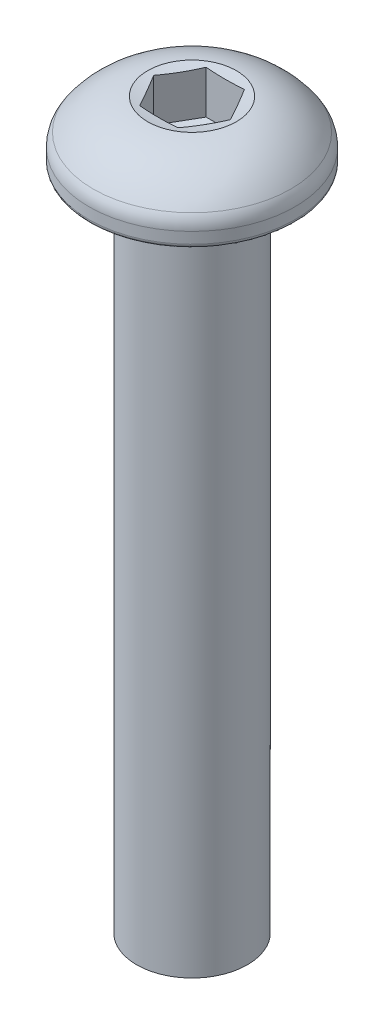
ISO-10303-21;
HEADER;
FILE_DESCRIPTION(('STEP AP214'),'2;1');
FILE_NAME('part.step','',(''),(''),'','','');
FILE_SCHEMA(('AUTOMOTIVE_DESIGN { 1 0 10303 214 1 1 1 1 }'));
ENDSEC;
DATA;
#1=APPLICATION_CONTEXT('core data for automotive mechanical design processes');
#2=APPLICATION_PROTOCOL_DEFINITION('international standard','automotive_design',2000,#1);
#3=PRODUCT_CONTEXT('',#1,'mechanical');
#4=PRODUCT('Part','Part','',(#3));
#5=PRODUCT_RELATED_PRODUCT_CATEGORY('part','',(#4));
#6=PRODUCT_DEFINITION_FORMATION('','',#4);
#7=PRODUCT_DEFINITION_CONTEXT('part definition',#1,'design');
#8=PRODUCT_DEFINITION('design','',#6,#7);
#9=PRODUCT_DEFINITION_SHAPE('','',#8);
#10=(LENGTH_UNIT() NAMED_UNIT(*) SI_UNIT(.MILLI.,.METRE.));
#11=(NAMED_UNIT(*) PLANE_ANGLE_UNIT() SI_UNIT($,.RADIAN.));
#12=(NAMED_UNIT(*) SI_UNIT($,.STERADIAN.) SOLID_ANGLE_UNIT());
#13=UNCERTAINTY_MEASURE_WITH_UNIT(LENGTH_MEASURE(1.E-05),#10,'distance_accuracy_value','');
#14=(GEOMETRIC_REPRESENTATION_CONTEXT(3) GLOBAL_UNCERTAINTY_ASSIGNED_CONTEXT((#13)) GLOBAL_UNIT_ASSIGNED_CONTEXT((#10,
#11,#12)) REPRESENTATION_CONTEXT('',''));
#15=CARTESIAN_POINT('',(0.,0.,0.));
#16=DIRECTION('',(0.,0.,1.));
#17=DIRECTION('',(1.,0.,0.));
#18=AXIS2_PLACEMENT_3D('',#15,#16,#17);
#19=CARTESIAN_POINT('',(0.,-0.781135566534529,0.));
#20=DIRECTION('',(0.,1.,0.));
#21=DIRECTION('',(0.,0.,1.));
#22=AXIS2_PLACEMENT_3D('',#19,#20,#21);
#23=DEGENERATE_TOROIDAL_SURFACE('',#22,1.63710171203445,3.5,.T.);
#24=CARTESIAN_POINT('',(0.,1.29456945714261,0.));
#25=DIRECTION('',(0.,-1.,0.));
#26=DIRECTION('',(0.,0.,-1.));
#27=AXIS2_PLACEMENT_3D('',#24,#25,#26);
#28=CIRCLE('',#27,4.45515931518622);
#29=CARTESIAN_POINT('',(0.,1.29456945714261,-4.45515931518622));
#30=VERTEX_POINT('',#29);
#31=EDGE_CURVE('E135',#30,#30,#28,.F.);
#32=ORIENTED_EDGE('',*,*,#31,.T.);
#33=EDGE_LOOP('',(#32));
#34=FACE_BOUND('',#33,.T.);
#35=CARTESIAN_POINT('',(0.,2.7,0.));
#36=DIRECTION('',(0.,1.,0.));
#37=DIRECTION('',(0.,0.,1.));
#38=AXIS2_PLACEMENT_3D('',#35,#36,#37);
#39=CIRCLE('',#38,2.);
#40=CARTESIAN_POINT('',(0.,2.7,2.));
#41=VERTEX_POINT('',#40);
#42=EDGE_CURVE('E209',#41,#41,#39,.T.);
#43=ORIENTED_EDGE('',*,*,#42,.F.);
#44=EDGE_LOOP('',(#43));
#45=FACE_BOUND('',#44,.T.);
#46=ADVANCED_FACE('F41',(#34,#45),#23,.T.);
#47=CARTESIAN_POINT('',(0.,55.,0.));
#48=DIRECTION('',(0.,1.,0.));
#49=DIRECTION('',(0.,0.,1.));
#50=AXIS2_PLACEMENT_3D('',#47,#48,#49);
#51=CYLINDRICAL_SURFACE('',#50,4.65);
#52=CARTESIAN_POINT('',(0.,0.701510878949145,0.));
#53=DIRECTION('',(0.,-1.,0.));
#54=DIRECTION('',(0.,0.,-1.));
#55=AXIS2_PLACEMENT_3D('',#52,#53,#54);
#56=CIRCLE('',#55,4.65);
#57=CARTESIAN_POINT('',(0.,0.701510878949145,-4.65));
#58=VERTEX_POINT('',#57);
#59=EDGE_CURVE('E138',#58,#58,#56,.T.);
#60=ORIENTED_EDGE('',*,*,#59,.T.);
#61=EDGE_LOOP('',(#60));
#62=FACE_BOUND('',#61,.T.);
#63=CARTESIAN_POINT('',(0.,0.199999999999999,0.));
#64=DIRECTION('',(0.,1.,0.));
#65=DIRECTION('',(0.,0.,1.));
#66=AXIS2_PLACEMENT_3D('',#63,#64,#65);
#67=CIRCLE('',#66,4.65);
#68=CARTESIAN_POINT('',(0.,0.199999999999999,4.65));
#69=VERTEX_POINT('',#68);
#70=EDGE_CURVE('E129',#69,#69,#67,.T.);
#71=ORIENTED_EDGE('',*,*,#70,.T.);
#72=EDGE_LOOP('',(#71));
#73=FACE_BOUND('',#72,.T.);
#74=ADVANCED_FACE('F149',(#62,#73),#51,.T.);
#75=CARTESIAN_POINT('',(0.,0.,0.));
#76=DIRECTION('',(0.,1.,0.));
#77=DIRECTION('',(0.,0.,1.));
#78=AXIS2_PLACEMENT_3D('',#75,#76,#77);
#79=PLANE('',#78);
#80=CARTESIAN_POINT('',(0.,0.,0.));
#81=DIRECTION('',(0.,1.,0.));
#82=DIRECTION('',(0.,0.,1.));
#83=AXIS2_PLACEMENT_3D('',#80,#81,#82);
#84=CIRCLE('',#83,2.5);
#85=CARTESIAN_POINT('',(0.,0.,2.5));
#86=VERTEX_POINT('',#85);
#87=EDGE_CURVE('E49',#86,#86,#84,.F.);
#88=ORIENTED_EDGE('',*,*,#87,.F.);
#89=EDGE_LOOP('',(#88));
#90=FACE_BOUND('',#89,.T.);
#91=CARTESIAN_POINT('',(0.,0.,0.));
#92=DIRECTION('',(0.,1.,0.));
#93=DIRECTION('',(0.,0.,1.));
#94=AXIS2_PLACEMENT_3D('',#91,#92,#93);
#95=CIRCLE('',#94,4.45);
#96=CARTESIAN_POINT('',(0.,0.,4.45));
#97=VERTEX_POINT('',#96);
#98=EDGE_CURVE('E132',#97,#97,#95,.F.);
#99=ORIENTED_EDGE('',*,*,#98,.T.);
#100=EDGE_LOOP('',(#99));
#101=FACE_BOUND('',#100,.T.);
#102=ADVANCED_FACE('F145',(#90,#101),#79,.F.);
#103=CARTESIAN_POINT('',(0.,0.199999999999999,0.));
#104=DIRECTION('',(0.,1.,0.));
#105=DIRECTION('',(0.,0.,1.));
#106=AXIS2_PLACEMENT_3D('',#103,#104,#105);
#107=TOROIDAL_SURFACE('',#106,4.45,0.2);
#108=ORIENTED_EDGE('',*,*,#98,.F.);
#109=EDGE_LOOP('',(#108));
#110=FACE_BOUND('',#109,.T.);
#111=ORIENTED_EDGE('',*,*,#70,.F.);
#112=EDGE_LOOP('',(#111));
#113=FACE_BOUND('',#112,.T.);
#114=ADVANCED_FACE('F148',(#110,#113),#107,.T.);
#115=CARTESIAN_POINT('',(0.,0.701510878949145,0.));
#116=DIRECTION('',(0.,-1.,0.));
#117=DIRECTION('',(0.,0.,-1.));
#118=AXIS2_PLACEMENT_3D('',#115,#116,#117);
#119=TOROIDAL_SURFACE('',#118,3.65,1.);
#120=ORIENTED_EDGE('',*,*,#59,.F.);
#121=EDGE_LOOP('',(#120));
#122=FACE_BOUND('',#121,.T.);
#123=ORIENTED_EDGE('',*,*,#31,.F.);
#124=EDGE_LOOP('',(#123));
#125=FACE_BOUND('',#124,.T.);
#126=ADVANCED_FACE('F43',(#122,#125),#119,.T.);
#127=CARTESIAN_POINT('',(0.,-30.,0.));
#128=DIRECTION('',(0.,1.,0.));
#129=DIRECTION('',(0.,0.,1.));
#130=AXIS2_PLACEMENT_3D('',#127,#128,#129);
#131=CYLINDRICAL_SURFACE('',#130,2.5);
#132=CARTESIAN_POINT('',(0.,-30.,0.));
#133=DIRECTION('',(0.,-1.,0.));
#134=DIRECTION('',(0.,0.,-1.));
#135=AXIS2_PLACEMENT_3D('',#132,#133,#134);
#136=CIRCLE('',#135,2.5);
#137=CARTESIAN_POINT('',(0.,-30.,-2.5));
#138=VERTEX_POINT('',#137);
#139=EDGE_CURVE('E126',#138,#138,#136,.T.);
#140=ORIENTED_EDGE('',*,*,#139,.F.);
#141=EDGE_LOOP('',(#140));
#142=FACE_BOUND('',#141,.T.);
#143=ORIENTED_EDGE('',*,*,#87,.T.);
#144=EDGE_LOOP('',(#143));
#145=FACE_BOUND('',#144,.T.);
#146=ADVANCED_FACE('F143',(#142,#145),#131,.T.);
#147=CARTESIAN_POINT('',(0.,-30.,0.));
#148=DIRECTION('',(0.,-1.,0.));
#149=DIRECTION('',(0.,0.,-1.));
#150=AXIS2_PLACEMENT_3D('',#147,#148,#149);
#151=PLANE('',#150);
#152=ORIENTED_EDGE('',*,*,#139,.T.);
#153=EDGE_LOOP('',(#152));
#154=FACE_BOUND('',#153,.T.);
#155=ADVANCED_FACE('F169',(#154),#151,.T.);
#156=CARTESIAN_POINT('',(0.,12.4979589711327,0.));
#157=DIRECTION('',(0.,1.,0.));
#158=DIRECTION('',(1.,0.,0.));
#159=AXIS2_PLACEMENT_3D('',#156,#157,#158);
#160=SPHERICAL_SURFACE('',#159,10.);
#161=ORIENTED_EDGE('',*,*,#42,.T.);
#162=EDGE_LOOP('',(#161));
#163=FACE_BOUND('',#162,.T.);
#164=CARTESIAN_POINT('',(-1.29903810567666,12.4979589711327,0.749999999999999));
#165=DIRECTION('',(-0.866025403784438,0.,0.5));
#166=DIRECTION('',(0.5,0.,0.866025403784439));
#167=AXIS2_PLACEMENT_3D('',#164,#165,#166);
#168=CIRCLE('',#167,9.88685996664259);
#169=CARTESIAN_POINT('',(-1.73205080756888,2.64910116933661,0.));
#170=VERTEX_POINT('',#169);
#171=CARTESIAN_POINT('',(-0.866025403784437,2.64910116933661,1.5));
#172=VERTEX_POINT('',#171);
#173=EDGE_CURVE('E113',#170,#172,#168,.T.);
#174=ORIENTED_EDGE('',*,*,#173,.F.);
#175=CARTESIAN_POINT('',(-1.29903810567666,12.4979589711327,-0.75));
#176=DIRECTION('',(-0.866025403784439,0.,-0.5));
#177=DIRECTION('',(-0.5,0.,0.866025403784439));
#178=AXIS2_PLACEMENT_3D('',#175,#176,#177);
#179=CIRCLE('',#178,9.88685996664259);
#180=CARTESIAN_POINT('',(-0.866025403784438,2.64910116933661,-1.5));
#181=VERTEX_POINT('',#180);
#182=EDGE_CURVE('E217',#181,#170,#179,.T.);
#183=ORIENTED_EDGE('',*,*,#182,.F.);
#184=CARTESIAN_POINT('',(0.,12.4979589711327,-1.5));
#185=DIRECTION('',(0.,0.,-1.));
#186=DIRECTION('',(-1.,0.,0.));
#187=AXIS2_PLACEMENT_3D('',#184,#185,#186);
#188=CIRCLE('',#187,9.88685996664259);
#189=CARTESIAN_POINT('',(0.866025403784439,2.64910116933661,-1.5));
#190=VERTEX_POINT('',#189);
#191=EDGE_CURVE('E212',#190,#181,#188,.T.);
#192=ORIENTED_EDGE('',*,*,#191,.F.);
#193=CARTESIAN_POINT('',(1.29903810567666,12.4979589711327,-0.750000000000002));
#194=DIRECTION('',(0.866025403784439,0.,-0.5));
#195=DIRECTION('',(-0.5,0.,-0.866025403784438));
#196=AXIS2_PLACEMENT_3D('',#193,#194,#195);
#197=CIRCLE('',#196,9.88685996664259);
#198=CARTESIAN_POINT('',(1.73205080756888,2.64910116933661,0.));
#199=VERTEX_POINT('',#198);
#200=EDGE_CURVE('E56',#199,#190,#197,.T.);
#201=ORIENTED_EDGE('',*,*,#200,.F.);
#202=CARTESIAN_POINT('',(1.29903810567666,12.4979589711327,0.75));
#203=DIRECTION('',(0.866025403784439,0.,0.5));
#204=DIRECTION('',(0.5,0.,-0.866025403784439));
#205=AXIS2_PLACEMENT_3D('',#202,#203,#204);
#206=CIRCLE('',#205,9.88685996664259);
#207=CARTESIAN_POINT('',(0.866025403784439,2.64910116933661,1.5));
#208=VERTEX_POINT('',#207);
#209=EDGE_CURVE('E11',#208,#199,#206,.T.);
#210=ORIENTED_EDGE('',*,*,#209,.F.);
#211=CARTESIAN_POINT('',(0.,12.4979589711327,1.5));
#212=DIRECTION('',(0.,0.,1.));
#213=DIRECTION('',(1.,0.,0.));
#214=AXIS2_PLACEMENT_3D('',#211,#212,#213);
#215=CIRCLE('',#214,9.88685996664259);
#216=EDGE_CURVE('E97',#172,#208,#215,.T.);
#217=ORIENTED_EDGE('',*,*,#216,.F.);
#218=EDGE_LOOP('',(#174,#183,#192,#201,#210,#217));
#219=FACE_BOUND('',#218,.T.);
#220=ADVANCED_FACE('F96',(#163,#219),#160,.F.);
#221=CARTESIAN_POINT('',(0.,10.0185783848852,-1.89618524935331));
#222=DIRECTION('',(-1.,0.,0.));
#223=DIRECTION('',(0.,0.,1.));
#224=AXIS2_PLACEMENT_3D('',#221,#222,#223);
#225=CIRCLE('',#224,10.);
#226=TRIMMED_CURVE('',#225,(PARAMETER_VALUE(-1.38002271857551)),
(PARAMETER_VALUE(1.38002271857551)),.T.,.PARAMETER.);
#227=CARTESIAN_POINT('',(0.,10.0185783848852,0.));
#228=DIRECTION('',(0.,1.,0.));
#229=AXIS1_PLACEMENT('',#227,#228);
#230=SURFACE_OF_REVOLUTION('',#226,#229);
#231=CARTESIAN_POINT('',(0.,0.699999999999999,0.));
#232=DIRECTION('',(0.,1.,0.));
#233=DIRECTION('',(0.,0.,1.));
#234=AXIS2_PLACEMENT_3D('',#231,#232,#233);
#235=CIRCLE('',#234,1.73205080756888);
#236=CARTESIAN_POINT('',(0.866025403784434,0.699999999999999,1.50000000000001));
#237=VERTEX_POINT('',#236);
#238=CARTESIAN_POINT('',(1.73205080756888,0.699999999999999,0.));
#239=VERTEX_POINT('',#238);
#240=EDGE_CURVE('E221',#237,#239,#235,.T.);
#241=ORIENTED_EDGE('',*,*,#240,.T.);
#242=CARTESIAN_POINT('',(0.866025403784442,0.699999999999999,-1.5));
#243=VERTEX_POINT('',#242);
#244=EDGE_CURVE('E225',#239,#243,#235,.T.);
#245=ORIENTED_EDGE('',*,*,#244,.T.);
#246=CARTESIAN_POINT('',(-0.866025403784433,0.699999999999999,-1.50000000000001));
#247=VERTEX_POINT('',#246);
#248=EDGE_CURVE('E251',#243,#247,#235,.T.);
#249=ORIENTED_EDGE('',*,*,#248,.T.);
#250=CARTESIAN_POINT('',(-1.73205080756888,0.7,0.));
#251=VERTEX_POINT('',#250);
#252=EDGE_CURVE('E63',#247,#251,#235,.T.);
#253=ORIENTED_EDGE('',*,*,#252,.T.);
#254=CARTESIAN_POINT('',(-0.866025403784431,0.699999999999999,1.50000000000001));
#255=VERTEX_POINT('',#254);
#256=EDGE_CURVE('E277',#251,#255,#235,.T.);
#257=ORIENTED_EDGE('',*,*,#256,.T.);
#258=EDGE_CURVE('E112',#255,#237,#235,.T.);
#259=ORIENTED_EDGE('',*,*,#258,.T.);
#260=EDGE_LOOP('',(#241,#245,#249,#253,#257,#259));
#261=FACE_BOUND('',#260,.T.);
#262=CARTESIAN_POINT('',(0.,0.2,0.));
#263=VERTEX_POINT('',#262);
#264=VERTEX_LOOP('',#263);
#265=FACE_BOUND('',#264,.T.);
#266=ADVANCED_FACE('F199',(#261,#265),#230,.F.);
#267=CARTESIAN_POINT('',(0.,0.700000000000001,0.));
#268=DIRECTION('',(0.,-1.,0.));
#269=DIRECTION('',(0.,0.,-1.));
#270=AXIS2_PLACEMENT_3D('',#267,#268,#269);
#271=PLANE('',#270);
#272=DIRECTION('',(1.,0.,0.));
#273=VECTOR('',#272,1.);
#274=CARTESIAN_POINT('',(-0.866025403784438,0.7,1.5));
#275=LINE('',#274,#273);
#276=EDGE_CURVE('E224',#255,#237,#275,.T.);
#277=ORIENTED_EDGE('',*,*,#276,.T.);
#278=ORIENTED_EDGE('',*,*,#258,.F.);
#279=EDGE_LOOP('',(#277,#278));
#280=FACE_BOUND('',#279,.T.);
#281=ADVANCED_FACE('F195',(#280),#271,.T.);
#282=DIRECTION('',(0.5,0.,0.866025403784438));
#283=VECTOR('',#282,1.);
#284=CARTESIAN_POINT('',(-1.73205080756888,0.7,0.));
#285=LINE('',#284,#283);
#286=EDGE_CURVE('E118',#251,#255,#285,.T.);
#287=ORIENTED_EDGE('',*,*,#286,.T.);
#288=ORIENTED_EDGE('',*,*,#256,.F.);
#289=EDGE_LOOP('',(#287,#288));
#290=FACE_BOUND('',#289,.T.);
#291=ADVANCED_FACE('F198',(#290),#271,.T.);
#292=DIRECTION('',(-0.5,0.,0.866025403784439));
#293=VECTOR('',#292,1.);
#294=CARTESIAN_POINT('',(-0.866025403784438,0.7,-1.5));
#295=LINE('',#294,#293);
#296=EDGE_CURVE('E122',#247,#251,#295,.T.);
#297=ORIENTED_EDGE('',*,*,#296,.T.);
#298=ORIENTED_EDGE('',*,*,#252,.F.);
#299=EDGE_LOOP('',(#297,#298));
#300=FACE_BOUND('',#299,.T.);
#301=ADVANCED_FACE('F265',(#300),#271,.T.);
#302=DIRECTION('',(-1.,0.,0.));
#303=VECTOR('',#302,1.);
#304=CARTESIAN_POINT('',(0.866025403784439,0.7,-1.5));
#305=LINE('',#304,#303);
#306=EDGE_CURVE('E230',#243,#247,#305,.T.);
#307=ORIENTED_EDGE('',*,*,#306,.T.);
#308=ORIENTED_EDGE('',*,*,#248,.F.);
#309=EDGE_LOOP('',(#307,#308));
#310=FACE_BOUND('',#309,.T.);
#311=ADVANCED_FACE('F252',(#310),#271,.T.);
#312=DIRECTION('',(-0.5,0.,-0.866025403784438));
#313=VECTOR('',#312,1.);
#314=CARTESIAN_POINT('',(1.73205080756888,0.7,0.));
#315=LINE('',#314,#313);
#316=EDGE_CURVE('E228',#239,#243,#315,.T.);
#317=ORIENTED_EDGE('',*,*,#316,.T.);
#318=ORIENTED_EDGE('',*,*,#244,.F.);
#319=EDGE_LOOP('',(#317,#318));
#320=FACE_BOUND('',#319,.T.);
#321=ADVANCED_FACE('F248',(#320),#271,.T.);
#322=DIRECTION('',(0.5,0.,-0.866025403784439));
#323=VECTOR('',#322,1.);
#324=CARTESIAN_POINT('',(0.866025403784439,0.7,1.5));
#325=LINE('',#324,#323);
#326=EDGE_CURVE('E116',#237,#239,#325,.T.);
#327=ORIENTED_EDGE('',*,*,#326,.T.);
#328=ORIENTED_EDGE('',*,*,#240,.F.);
#329=EDGE_LOOP('',(#327,#328));
#330=FACE_BOUND('',#329,.T.);
#331=ADVANCED_FACE('F180',(#330),#271,.T.);
#332=CARTESIAN_POINT('',(0.866025403784439,0.7,1.5));
#333=DIRECTION('',(0.866025403784439,0.,0.5));
#334=DIRECTION('',(0.5,0.,-0.866025403784439));
#335=AXIS2_PLACEMENT_3D('',#332,#333,#334);
#336=PLANE('',#335);
#337=DIRECTION('',(0.,1.,0.));
#338=VECTOR('',#337,1.);
#339=CARTESIAN_POINT('',(0.866025403784439,0.7,1.5));
#340=LINE('',#339,#338);
#341=EDGE_CURVE('E108',#237,#208,#340,.T.);
#342=ORIENTED_EDGE('',*,*,#341,.T.);
#343=ORIENTED_EDGE('',*,*,#209,.T.);
#344=DIRECTION('',(0.,1.,0.));
#345=VECTOR('',#344,1.);
#346=CARTESIAN_POINT('',(1.73205080756888,0.7,0.));
#347=LINE('',#346,#345);
#348=EDGE_CURVE('E117',#239,#199,#347,.T.);
#349=ORIENTED_EDGE('',*,*,#348,.F.);
#350=ORIENTED_EDGE('',*,*,#326,.F.);
#351=EDGE_LOOP('',(#342,#343,#349,#350));
#352=FACE_BOUND('',#351,.T.);
#353=ADVANCED_FACE('F115',(#352),#336,.F.);
#354=CARTESIAN_POINT('',(1.73205080756888,0.7,0.));
#355=DIRECTION('',(0.866025403784439,0.,-0.5));
#356=DIRECTION('',(-0.5,0.,-0.866025403784438));
#357=AXIS2_PLACEMENT_3D('',#354,#355,#356);
#358=PLANE('',#357);
#359=ORIENTED_EDGE('',*,*,#348,.T.);
#360=ORIENTED_EDGE('',*,*,#200,.T.);
#361=DIRECTION('',(0.,1.,0.));
#362=VECTOR('',#361,1.);
#363=CARTESIAN_POINT('',(0.866025403784439,0.7,-1.5));
#364=LINE('',#363,#362);
#365=EDGE_CURVE('E120',#243,#190,#364,.T.);
#366=ORIENTED_EDGE('',*,*,#365,.F.);
#367=ORIENTED_EDGE('',*,*,#316,.F.);
#368=EDGE_LOOP('',(#359,#360,#366,#367));
#369=FACE_BOUND('',#368,.T.);
#370=ADVANCED_FACE('F179',(#369),#358,.F.);
#371=CARTESIAN_POINT('',(0.866025403784439,0.7,-1.5));
#372=DIRECTION('',(0.,0.,-1.));
#373=DIRECTION('',(-1.,0.,0.));
#374=AXIS2_PLACEMENT_3D('',#371,#372,#373);
#375=PLANE('',#374);
#376=ORIENTED_EDGE('',*,*,#365,.T.);
#377=ORIENTED_EDGE('',*,*,#191,.T.);
#378=DIRECTION('',(0.,1.,0.));
#379=VECTOR('',#378,1.);
#380=CARTESIAN_POINT('',(-0.866025403784438,0.7,-1.5));
#381=LINE('',#380,#379);
#382=EDGE_CURVE('E238',#247,#181,#381,.T.);
#383=ORIENTED_EDGE('',*,*,#382,.F.);
#384=ORIENTED_EDGE('',*,*,#306,.F.);
#385=EDGE_LOOP('',(#376,#377,#383,#384));
#386=FACE_BOUND('',#385,.T.);
#387=ADVANCED_FACE('F183',(#386),#375,.F.);
#388=CARTESIAN_POINT('',(-0.866025403784438,0.7,-1.5));
#389=DIRECTION('',(-0.866025403784439,0.,-0.5));
#390=DIRECTION('',(-0.5,0.,0.866025403784439));
#391=AXIS2_PLACEMENT_3D('',#388,#389,#390);
#392=PLANE('',#391);
#393=ORIENTED_EDGE('',*,*,#382,.T.);
#394=ORIENTED_EDGE('',*,*,#182,.T.);
#395=DIRECTION('',(0.,1.,0.));
#396=VECTOR('',#395,1.);
#397=CARTESIAN_POINT('',(-1.73205080756888,0.7,0.));
#398=LINE('',#397,#396);
#399=EDGE_CURVE('E235',#251,#170,#398,.T.);
#400=ORIENTED_EDGE('',*,*,#399,.F.);
#401=ORIENTED_EDGE('',*,*,#296,.F.);
#402=EDGE_LOOP('',(#393,#394,#400,#401));
#403=FACE_BOUND('',#402,.T.);
#404=ADVANCED_FACE('F187',(#403),#392,.F.);
#405=CARTESIAN_POINT('',(-1.73205080756888,0.7,0.));
#406=DIRECTION('',(-0.866025403784438,0.,0.5));
#407=DIRECTION('',(0.5,0.,0.866025403784439));
#408=AXIS2_PLACEMENT_3D('',#405,#406,#407);
#409=PLANE('',#408);
#410=ORIENTED_EDGE('',*,*,#399,.T.);
#411=ORIENTED_EDGE('',*,*,#173,.T.);
#412=DIRECTION('',(0.,1.,0.));
#413=VECTOR('',#412,1.);
#414=CARTESIAN_POINT('',(-0.866025403784438,0.7,1.5));
#415=LINE('',#414,#413);
#416=EDGE_CURVE('E111',#255,#172,#415,.T.);
#417=ORIENTED_EDGE('',*,*,#416,.F.);
#418=ORIENTED_EDGE('',*,*,#286,.F.);
#419=EDGE_LOOP('',(#410,#411,#417,#418));
#420=FACE_BOUND('',#419,.T.);
#421=ADVANCED_FACE('F176',(#420),#409,.F.);
#422=CARTESIAN_POINT('',(-0.866025403784438,0.7,1.5));
#423=DIRECTION('',(0.,0.,1.));
#424=DIRECTION('',(1.,0.,0.));
#425=AXIS2_PLACEMENT_3D('',#422,#423,#424);
#426=PLANE('',#425);
#427=ORIENTED_EDGE('',*,*,#416,.T.);
#428=ORIENTED_EDGE('',*,*,#216,.T.);
#429=ORIENTED_EDGE('',*,*,#341,.F.);
#430=ORIENTED_EDGE('',*,*,#276,.F.);
#431=EDGE_LOOP('',(#427,#428,#429,#430));
#432=FACE_BOUND('',#431,.T.);
#433=ADVANCED_FACE('F106',(#432),#426,.F.);
#434=CLOSED_SHELL('',(#46,#74,#102,#114,#126,#146,#155,#220,#266,#281,#291,#301,#311,#321,#331,
#353,#370,#387,#404,#421,#433));
#435=MANIFOLD_SOLID_BREP('B2',#434);
#436=ADVANCED_BREP_SHAPE_REPRESENTATION('',(#18,#435),#14);
#437=SHAPE_DEFINITION_REPRESENTATION(#9,#436);
ENDSEC;
END-ISO-10303-21;
